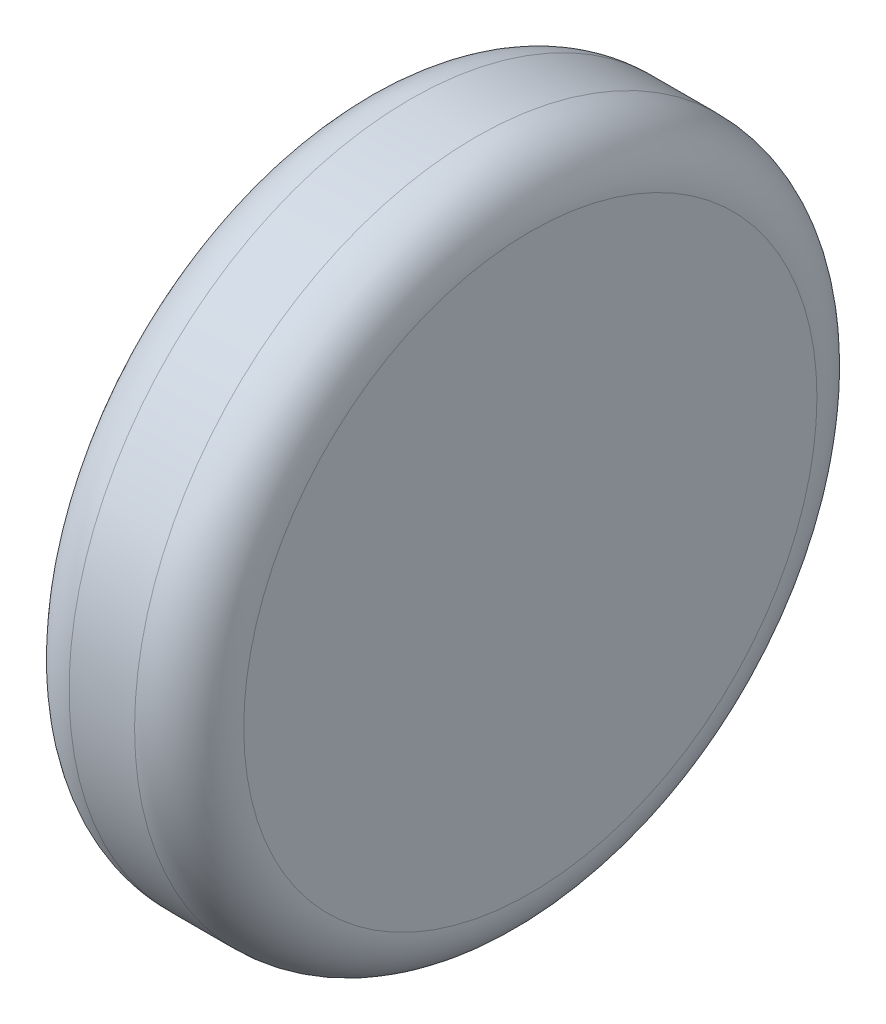
ISO-10303-21;
HEADER;
FILE_DESCRIPTION(('STEP AP214'),'2;1');
FILE_NAME('part.step','',(''),(''),'','','');
FILE_SCHEMA(('AUTOMOTIVE_DESIGN { 1 0 10303 214 1 1 1 1 }'));
ENDSEC;
DATA;
#1=APPLICATION_CONTEXT('core data for automotive mechanical design processes');
#2=APPLICATION_PROTOCOL_DEFINITION('international standard','automotive_design',2000,#1);
#3=PRODUCT_CONTEXT('',#1,'mechanical');
#4=PRODUCT('Part','Part','',(#3));
#5=PRODUCT_RELATED_PRODUCT_CATEGORY('part','',(#4));
#6=PRODUCT_DEFINITION_FORMATION('','',#4);
#7=PRODUCT_DEFINITION_CONTEXT('part definition',#1,'design');
#8=PRODUCT_DEFINITION('design','',#6,#7);
#9=PRODUCT_DEFINITION_SHAPE('','',#8);
#10=(LENGTH_UNIT() NAMED_UNIT(*) SI_UNIT(.MILLI.,.METRE.));
#11=(NAMED_UNIT(*) PLANE_ANGLE_UNIT() SI_UNIT($,.RADIAN.));
#12=(NAMED_UNIT(*) SI_UNIT($,.STERADIAN.) SOLID_ANGLE_UNIT());
#13=UNCERTAINTY_MEASURE_WITH_UNIT(LENGTH_MEASURE(1.E-05),#10,'distance_accuracy_value','');
#14=(GEOMETRIC_REPRESENTATION_CONTEXT(3) GLOBAL_UNCERTAINTY_ASSIGNED_CONTEXT((#13)) GLOBAL_UNIT_ASSIGNED_CONTEXT((#10,
#11,#12)) REPRESENTATION_CONTEXT('',''));
#15=CARTESIAN_POINT('',(0.,0.,0.));
#16=DIRECTION('',(0.,0.,1.));
#17=DIRECTION('',(1.,0.,0.));
#18=AXIS2_PLACEMENT_3D('',#15,#16,#17);
#19=CARTESIAN_POINT('',(0.959635714690616,-0.332340218761648,0.1012));
#20=DIRECTION('',(1.,0.,0.));
#21=DIRECTION('',(0.,1.,0.));
#22=AXIS2_PLACEMENT_3D('',#19,#20,#21);
#23=PLANE('',#22);
#24=CARTESIAN_POINT('',(0.959635714690616,-0.332340218761648,0.1012));
#25=DIRECTION('',(1.,0.,0.));
#26=DIRECTION('',(0.,0.,-1.));
#27=AXIS2_PLACEMENT_3D('',#24,#25,#26);
#28=CIRCLE('',#27,0.0262499999999999);
#29=CARTESIAN_POINT('',(0.959635714690616,-0.332340218761648,0.0749500000000001));
#30=VERTEX_POINT('',#29);
#31=CARTESIAN_POINT('',(0.959635714690616,-0.306090218761648,0.1012));
#32=VERTEX_POINT('',#31);
#33=EDGE_CURVE('E55',#30,#32,#28,.T.);
#34=ORIENTED_EDGE('',*,*,#33,.F.);
#35=CARTESIAN_POINT('',(0.959635714690616,-0.332340218761648,0.1012));
#36=DIRECTION('',(1.,0.,0.));
#37=DIRECTION('',(0.,0.,1.));
#38=AXIS2_PLACEMENT_3D('',#35,#36,#37);
#39=CIRCLE('',#38,0.02625);
#40=CARTESIAN_POINT('',(0.959635714690616,-0.332340218761648,0.12745));
#41=VERTEX_POINT('',#40);
#42=EDGE_CURVE('E49',#41,#30,#39,.T.);
#43=ORIENTED_EDGE('',*,*,#42,.F.);
#44=CARTESIAN_POINT('',(0.959635714690616,-0.332340218761648,0.1012));
#45=DIRECTION('',(1.,0.,0.));
#46=DIRECTION('',(0.,1.,0.));
#47=AXIS2_PLACEMENT_3D('',#44,#45,#46);
#48=CIRCLE('',#47,0.02625);
#49=EDGE_CURVE('E53',#32,#41,#48,.T.);
#50=ORIENTED_EDGE('',*,*,#49,.F.);
#51=EDGE_LOOP('',(#34,#43,#50));
#52=FACE_BOUND('',#51,.T.);
#53=ADVANCED_FACE('F17',(#52),#23,.F.);
#54=CARTESIAN_POINT('',(0.964635714690616,-0.332340218761648,0.1012));
#55=DIRECTION('',(1.,0.,0.));
#56=DIRECTION('',(0.,0.,1.));
#57=AXIS2_PLACEMENT_3D('',#54,#55,#56);
#58=TOROIDAL_SURFACE('',#57,0.02625,0.005);
#59=CARTESIAN_POINT('',(0.964635714690616,-0.332340218761648,0.1012));
#60=DIRECTION('',(1.,0.,0.));
#61=DIRECTION('',(0.,1.,0.));
#62=AXIS2_PLACEMENT_3D('',#59,#60,#61);
#63=CIRCLE('',#62,0.03125);
#64=CARTESIAN_POINT('',(0.964635714690616,-0.301090218761648,0.1012));
#65=VERTEX_POINT('',#64);
#66=EDGE_CURVE('E62',#65,#65,#63,.T.);
#67=ORIENTED_EDGE('',*,*,#66,.F.);
#68=EDGE_LOOP('',(#67));
#69=FACE_BOUND('',#68,.T.);
#70=ORIENTED_EDGE('',*,*,#33,.T.);
#71=ORIENTED_EDGE('',*,*,#49,.T.);
#72=ORIENTED_EDGE('',*,*,#42,.T.);
#73=EDGE_LOOP('',(#70,#71,#72));
#74=FACE_BOUND('',#73,.T.);
#75=ADVANCED_FACE('F60',(#69,#74),#58,.T.);
#76=CARTESIAN_POINT('',(0.975635714690617,-0.332340218761648,0.1012));
#77=DIRECTION('',(1.,0.,0.));
#78=DIRECTION('',(0.,1.,0.));
#79=AXIS2_PLACEMENT_3D('',#76,#77,#78);
#80=CYLINDRICAL_SURFACE('',#79,0.03125);
#81=CARTESIAN_POINT('',(0.970635714690617,-0.332340218761648,0.1012));
#82=DIRECTION('',(1.,0.,0.));
#83=DIRECTION('',(0.,0.,1.));
#84=AXIS2_PLACEMENT_3D('',#81,#82,#83);
#85=CIRCLE('',#84,0.03125);
#86=CARTESIAN_POINT('',(0.970635714690617,-0.332340218761648,0.13245));
#87=VERTEX_POINT('',#86);
#88=EDGE_CURVE('E86',#87,#87,#85,.T.);
#89=ORIENTED_EDGE('',*,*,#88,.F.);
#90=EDGE_LOOP('',(#89));
#91=FACE_BOUND('',#90,.T.);
#92=ORIENTED_EDGE('',*,*,#66,.T.);
#93=EDGE_LOOP('',(#92));
#94=FACE_BOUND('',#93,.T.);
#95=ADVANCED_FACE('F79',(#91,#94),#80,.T.);
#96=CARTESIAN_POINT('',(0.970635714690617,-0.332340218761648,0.1012));
#97=DIRECTION('',(1.,0.,0.));
#98=DIRECTION('',(0.,0.,1.));
#99=AXIS2_PLACEMENT_3D('',#96,#97,#98);
#100=TOROIDAL_SURFACE('',#99,0.02625,0.005);
#101=ORIENTED_EDGE('',*,*,#88,.T.);
#102=EDGE_LOOP('',(#101));
#103=FACE_BOUND('',#102,.T.);
#104=CARTESIAN_POINT('',(0.975635714690617,-0.332340218761648,0.1012));
#105=DIRECTION('',(-1.,0.,0.));
#106=DIRECTION('',(0.,0.,-1.));
#107=AXIS2_PLACEMENT_3D('',#104,#105,#106);
#108=CIRCLE('',#107,0.0262499999999999);
#109=CARTESIAN_POINT('',(0.975635714690617,-0.332340218761648,0.12745));
#110=VERTEX_POINT('',#109);
#111=CARTESIAN_POINT('',(0.975635714690617,-0.332340218761648,0.0749500000000001));
#112=VERTEX_POINT('',#111);
#113=EDGE_CURVE('E11',#110,#112,#108,.F.);
#114=ORIENTED_EDGE('',*,*,#113,.F.);
#115=CARTESIAN_POINT('',(0.975635714690617,-0.332340218761648,0.1012));
#116=DIRECTION('',(-1.,0.,0.));
#117=DIRECTION('',(0.,0.,1.));
#118=AXIS2_PLACEMENT_3D('',#115,#116,#117);
#119=CIRCLE('',#118,0.02625);
#120=CARTESIAN_POINT('',(0.975635714690617,-0.306090218761648,0.1012));
#121=VERTEX_POINT('',#120);
#122=EDGE_CURVE('E28',#121,#110,#119,.F.);
#123=ORIENTED_EDGE('',*,*,#122,.F.);
#124=CARTESIAN_POINT('',(0.975635714690617,-0.332340218761648,0.1012));
#125=DIRECTION('',(-1.,0.,0.));
#126=DIRECTION('',(0.,1.,0.));
#127=AXIS2_PLACEMENT_3D('',#124,#125,#126);
#128=CIRCLE('',#127,0.02625);
#129=EDGE_CURVE('E92',#112,#121,#128,.F.);
#130=ORIENTED_EDGE('',*,*,#129,.F.);
#131=EDGE_LOOP('',(#114,#123,#130));
#132=FACE_BOUND('',#131,.T.);
#133=ADVANCED_FACE('F117',(#103,#132),#100,.T.);
#134=CARTESIAN_POINT('',(0.975635714690617,-0.332340218761648,0.1012));
#135=DIRECTION('',(1.,0.,0.));
#136=DIRECTION('',(0.,1.,0.));
#137=AXIS2_PLACEMENT_3D('',#134,#135,#136);
#138=PLANE('',#137);
#139=ORIENTED_EDGE('',*,*,#122,.T.);
#140=ORIENTED_EDGE('',*,*,#113,.T.);
#141=ORIENTED_EDGE('',*,*,#129,.T.);
#142=EDGE_LOOP('',(#139,#140,#141));
#143=FACE_BOUND('',#142,.T.);
#144=ADVANCED_FACE('F99',(#143),#138,.T.);
#145=CLOSED_SHELL('',(#53,#75,#95,#133,#144));
#146=MANIFOLD_SOLID_BREP('B1',#145);
#147=ADVANCED_BREP_SHAPE_REPRESENTATION('',(#18,#146),#14);
#148=SHAPE_DEFINITION_REPRESENTATION(#9,#147);
ENDSEC;
END-ISO-10303-21;
